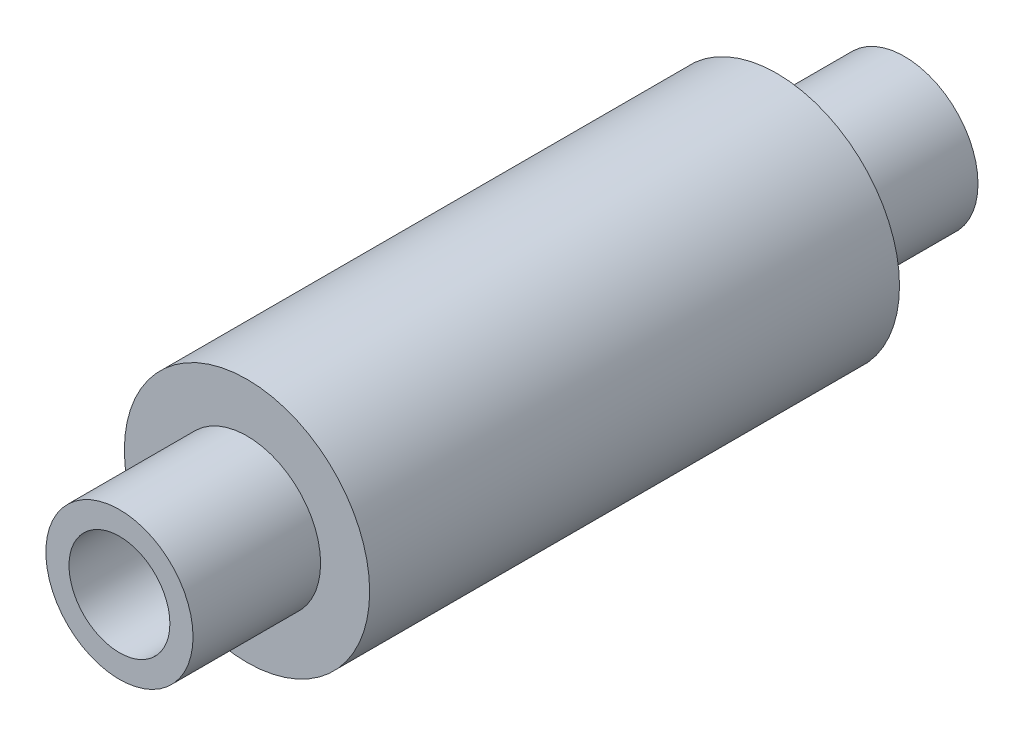
ISO-10303-21;
HEADER;
FILE_DESCRIPTION(('STEP AP214'),'2;1');
FILE_NAME('part.step','',(''),(''),'','','');
FILE_SCHEMA(('AUTOMOTIVE_DESIGN { 1 0 10303 214 1 1 1 1 }'));
ENDSEC;
DATA;
#1=APPLICATION_CONTEXT('core data for automotive mechanical design processes');
#2=APPLICATION_PROTOCOL_DEFINITION('international standard','automotive_design',2000,#1);
#3=PRODUCT_CONTEXT('',#1,'mechanical');
#4=PRODUCT('Part','Part','',(#3));
#5=PRODUCT_RELATED_PRODUCT_CATEGORY('part','',(#4));
#6=PRODUCT_DEFINITION_FORMATION('','',#4);
#7=PRODUCT_DEFINITION_CONTEXT('part definition',#1,'design');
#8=PRODUCT_DEFINITION('design','',#6,#7);
#9=PRODUCT_DEFINITION_SHAPE('','',#8);
#10=(LENGTH_UNIT() NAMED_UNIT(*) SI_UNIT(.MILLI.,.METRE.));
#11=(NAMED_UNIT(*) PLANE_ANGLE_UNIT() SI_UNIT($,.RADIAN.));
#12=(NAMED_UNIT(*) SI_UNIT($,.STERADIAN.) SOLID_ANGLE_UNIT());
#13=UNCERTAINTY_MEASURE_WITH_UNIT(LENGTH_MEASURE(1.E-05),#10,'distance_accuracy_value','');
#14=(GEOMETRIC_REPRESENTATION_CONTEXT(3) GLOBAL_UNCERTAINTY_ASSIGNED_CONTEXT((#13)) GLOBAL_UNIT_ASSIGNED_CONTEXT((#10,
#11,#12)) REPRESENTATION_CONTEXT('',''));
#15=CARTESIAN_POINT('',(0.,0.,0.));
#16=DIRECTION('',(0.,0.,1.));
#17=DIRECTION('',(1.,0.,0.));
#18=AXIS2_PLACEMENT_3D('',#15,#16,#17);
#19=CARTESIAN_POINT('',(0.,0.,25.4));
#20=DIRECTION('',(0.,0.,1.));
#21=DIRECTION('',(1.,0.,0.));
#22=AXIS2_PLACEMENT_3D('',#19,#20,#21);
#23=CYLINDRICAL_SURFACE('',#22,3.2639);
#24=CARTESIAN_POINT('',(0.,0.,0.));
#25=DIRECTION('',(0.,0.,1.));
#26=DIRECTION('',(1.,0.,0.));
#27=AXIS2_PLACEMENT_3D('',#24,#25,#26);
#28=CIRCLE('',#27,3.2639);
#29=CARTESIAN_POINT('',(3.2639,0.,0.));
#30=VERTEX_POINT('',#29);
#31=EDGE_CURVE('E40',#30,#30,#28,.F.);
#32=ORIENTED_EDGE('',*,*,#31,.T.);
#33=EDGE_LOOP('',(#32));
#34=FACE_BOUND('',#33,.T.);
#35=CARTESIAN_POINT('',(0.,0.,50.8));
#36=DIRECTION('',(0.,0.,1.));
#37=DIRECTION('',(1.,0.,0.));
#38=AXIS2_PLACEMENT_3D('',#35,#36,#37);
#39=CIRCLE('',#38,3.2639);
#40=CARTESIAN_POINT('',(3.2639,0.,50.8));
#41=VERTEX_POINT('',#40);
#42=EDGE_CURVE('E18',#41,#41,#39,.F.);
#43=ORIENTED_EDGE('',*,*,#42,.F.);
#44=EDGE_LOOP('',(#43));
#45=FACE_BOUND('',#44,.T.);
#46=ADVANCED_FACE('F15',(#34,#45),#23,.F.);
#47=CARTESIAN_POINT('',(0.,3.2639,50.8));
#48=DIRECTION('',(0.,0.,1.));
#49=DIRECTION('',(1.,0.,0.));
#50=AXIS2_PLACEMENT_3D('',#47,#48,#49);
#51=PLANE('',#50);
#52=ORIENTED_EDGE('',*,*,#42,.T.);
#53=EDGE_LOOP('',(#52));
#54=FACE_BOUND('',#53,.T.);
#55=CARTESIAN_POINT('',(0.,0.,50.8));
#56=DIRECTION('',(0.,0.,1.));
#57=DIRECTION('',(1.,0.,0.));
#58=AXIS2_PLACEMENT_3D('',#55,#56,#57);
#59=CIRCLE('',#58,4.7625);
#60=CARTESIAN_POINT('',(4.7625,0.,50.8));
#61=VERTEX_POINT('',#60);
#62=EDGE_CURVE('E38',#61,#61,#59,.F.);
#63=ORIENTED_EDGE('',*,*,#62,.F.);
#64=EDGE_LOOP('',(#63));
#65=FACE_BOUND('',#64,.T.);
#66=ADVANCED_FACE('F47',(#54,#65),#51,.T.);
#67=CARTESIAN_POINT('',(0.,4.7625,0.));
#68=DIRECTION('',(0.,0.,1.));
#69=DIRECTION('',(1.,0.,0.));
#70=AXIS2_PLACEMENT_3D('',#67,#68,#69);
#71=PLANE('',#70);
#72=ORIENTED_EDGE('',*,*,#31,.F.);
#73=EDGE_LOOP('',(#72));
#74=FACE_BOUND('',#73,.T.);
#75=CARTESIAN_POINT('',(0.,0.,0.));
#76=DIRECTION('',(0.,0.,1.));
#77=DIRECTION('',(1.,0.,0.));
#78=AXIS2_PLACEMENT_3D('',#75,#76,#77);
#79=CIRCLE('',#78,4.7625);
#80=CARTESIAN_POINT('',(4.7625,0.,0.));
#81=VERTEX_POINT('',#80);
#82=EDGE_CURVE('E35',#81,#81,#79,.T.);
#83=ORIENTED_EDGE('',*,*,#82,.F.);
#84=EDGE_LOOP('',(#83));
#85=FACE_BOUND('',#84,.T.);
#86=ADVANCED_FACE('F55',(#74,#85),#71,.F.);
#87=CARTESIAN_POINT('',(0.,0.,25.4));
#88=DIRECTION('',(0.,0.,1.));
#89=DIRECTION('',(1.,0.,0.));
#90=AXIS2_PLACEMENT_3D('',#87,#88,#89);
#91=CYLINDRICAL_SURFACE('',#90,4.7625);
#92=ORIENTED_EDGE('',*,*,#62,.T.);
#93=EDGE_LOOP('',(#92));
#94=FACE_BOUND('',#93,.T.);
#95=CARTESIAN_POINT('',(0.,0.,42.545));
#96=DIRECTION('',(0.,0.,1.));
#97=DIRECTION('',(1.,0.,0.));
#98=AXIS2_PLACEMENT_3D('',#95,#96,#97);
#99=CIRCLE('',#98,4.7625);
#100=CARTESIAN_POINT('',(4.7625,0.,42.545));
#101=VERTEX_POINT('',#100);
#102=EDGE_CURVE('E32',#101,#101,#99,.F.);
#103=ORIENTED_EDGE('',*,*,#102,.F.);
#104=EDGE_LOOP('',(#103));
#105=FACE_BOUND('',#104,.T.);
#106=ADVANCED_FACE('F74',(#94,#105),#91,.T.);
#107=CARTESIAN_POINT('',(0.,0.,25.4));
#108=DIRECTION('',(0.,0.,1.));
#109=DIRECTION('',(1.,0.,0.));
#110=AXIS2_PLACEMENT_3D('',#107,#108,#109);
#111=CYLINDRICAL_SURFACE('',#110,4.7625);
#112=CARTESIAN_POINT('',(0.,0.,8.255));
#113=DIRECTION('',(0.,0.,1.));
#114=DIRECTION('',(1.,0.,0.));
#115=AXIS2_PLACEMENT_3D('',#112,#113,#114);
#116=CIRCLE('',#115,4.7625);
#117=CARTESIAN_POINT('',(4.7625,0.,8.255));
#118=VERTEX_POINT('',#117);
#119=EDGE_CURVE('E27',#118,#118,#116,.F.);
#120=ORIENTED_EDGE('',*,*,#119,.T.);
#121=EDGE_LOOP('',(#120));
#122=FACE_BOUND('',#121,.T.);
#123=ORIENTED_EDGE('',*,*,#82,.T.);
#124=EDGE_LOOP('',(#123));
#125=FACE_BOUND('',#124,.T.);
#126=ADVANCED_FACE('F70',(#122,#125),#111,.T.);
#127=CARTESIAN_POINT('',(0.,4.7625,42.545));
#128=DIRECTION('',(0.,0.,1.));
#129=DIRECTION('',(1.,0.,0.));
#130=AXIS2_PLACEMENT_3D('',#127,#128,#129);
#131=PLANE('',#130);
#132=ORIENTED_EDGE('',*,*,#102,.T.);
#133=EDGE_LOOP('',(#132));
#134=FACE_BOUND('',#133,.T.);
#135=CARTESIAN_POINT('',(0.,0.,42.545));
#136=DIRECTION('',(0.,0.,1.));
#137=DIRECTION('',(1.,0.,0.));
#138=AXIS2_PLACEMENT_3D('',#135,#136,#137);
#139=CIRCLE('',#138,7.9375);
#140=CARTESIAN_POINT('',(7.9375,0.,42.545));
#141=VERTEX_POINT('',#140);
#142=EDGE_CURVE('E22',#141,#141,#139,.F.);
#143=ORIENTED_EDGE('',*,*,#142,.F.);
#144=EDGE_LOOP('',(#143));
#145=FACE_BOUND('',#144,.T.);
#146=ADVANCED_FACE('F64',(#134,#145),#131,.T.);
#147=CARTESIAN_POINT('',(0.,7.9375,8.255));
#148=DIRECTION('',(0.,0.,1.));
#149=DIRECTION('',(1.,0.,0.));
#150=AXIS2_PLACEMENT_3D('',#147,#148,#149);
#151=PLANE('',#150);
#152=ORIENTED_EDGE('',*,*,#119,.F.);
#153=EDGE_LOOP('',(#152));
#154=FACE_BOUND('',#153,.T.);
#155=CARTESIAN_POINT('',(0.,0.,8.255));
#156=DIRECTION('',(0.,0.,1.));
#157=DIRECTION('',(1.,0.,0.));
#158=AXIS2_PLACEMENT_3D('',#155,#156,#157);
#159=CIRCLE('',#158,7.9375);
#160=CARTESIAN_POINT('',(7.9375,0.,8.255));
#161=VERTEX_POINT('',#160);
#162=EDGE_CURVE('E10',#161,#161,#159,.T.);
#163=ORIENTED_EDGE('',*,*,#162,.F.);
#164=EDGE_LOOP('',(#163));
#165=FACE_BOUND('',#164,.T.);
#166=ADVANCED_FACE('F58',(#154,#165),#151,.F.);
#167=CARTESIAN_POINT('',(0.,0.,25.4));
#168=DIRECTION('',(0.,0.,1.));
#169=DIRECTION('',(1.,0.,0.));
#170=AXIS2_PLACEMENT_3D('',#167,#168,#169);
#171=CYLINDRICAL_SURFACE('',#170,7.9375);
#172=ORIENTED_EDGE('',*,*,#142,.T.);
#173=EDGE_LOOP('',(#172));
#174=FACE_BOUND('',#173,.T.);
#175=ORIENTED_EDGE('',*,*,#162,.T.);
#176=EDGE_LOOP('',(#175));
#177=FACE_BOUND('',#176,.T.);
#178=ADVANCED_FACE('F56',(#174,#177),#171,.T.);
#179=CLOSED_SHELL('',(#46,#66,#86,#106,#126,#146,#166,#178));
#180=MANIFOLD_SOLID_BREP('B1',#179);
#181=ADVANCED_BREP_SHAPE_REPRESENTATION('',(#18,#180),#14);
#182=SHAPE_DEFINITION_REPRESENTATION(#9,#181);
ENDSEC;
END-ISO-10303-21;
